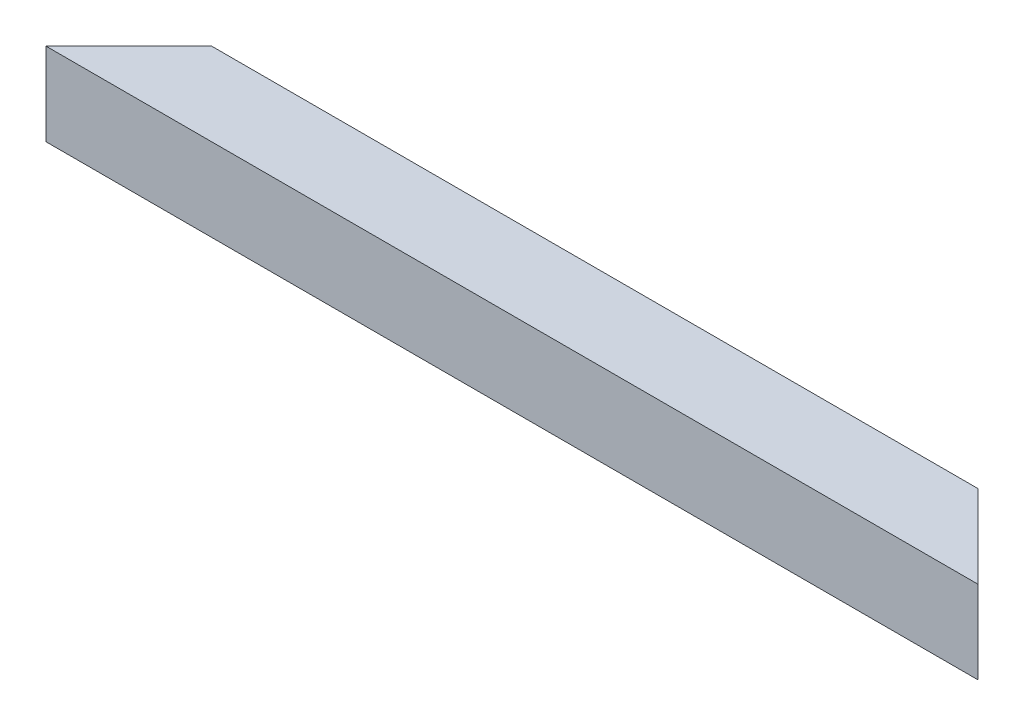
ISO-10303-21;
HEADER;
FILE_DESCRIPTION(('STEP AP214'),'2;1');
FILE_NAME('part.step','',(''),(''),'','','');
FILE_SCHEMA(('AUTOMOTIVE_DESIGN { 1 0 10303 214 1 1 1 1 }'));
ENDSEC;
DATA;
#1=APPLICATION_CONTEXT('core data for automotive mechanical design processes');
#2=APPLICATION_PROTOCOL_DEFINITION('international standard','automotive_design',2000,#1);
#3=PRODUCT_CONTEXT('',#1,'mechanical');
#4=PRODUCT('Part','Part','',(#3));
#5=PRODUCT_RELATED_PRODUCT_CATEGORY('part','',(#4));
#6=PRODUCT_DEFINITION_FORMATION('','',#4);
#7=PRODUCT_DEFINITION_CONTEXT('part definition',#1,'design');
#8=PRODUCT_DEFINITION('design','',#6,#7);
#9=PRODUCT_DEFINITION_SHAPE('','',#8);
#10=(LENGTH_UNIT() NAMED_UNIT(*) SI_UNIT(.MILLI.,.METRE.));
#11=(NAMED_UNIT(*) PLANE_ANGLE_UNIT() SI_UNIT($,.RADIAN.));
#12=(NAMED_UNIT(*) SI_UNIT($,.STERADIAN.) SOLID_ANGLE_UNIT());
#13=UNCERTAINTY_MEASURE_WITH_UNIT(LENGTH_MEASURE(1.E-05),#10,'distance_accuracy_value','');
#14=(GEOMETRIC_REPRESENTATION_CONTEXT(3) GLOBAL_UNCERTAINTY_ASSIGNED_CONTEXT((#13)) GLOBAL_UNIT_ASSIGNED_CONTEXT((#10,
#11,#12)) REPRESENTATION_CONTEXT('',''));
#15=CARTESIAN_POINT('',(0.,0.,0.));
#16=DIRECTION('',(0.,0.,1.));
#17=DIRECTION('',(1.,0.,0.));
#18=AXIS2_PLACEMENT_3D('',#15,#16,#17);
#19=CARTESIAN_POINT('',(-164.2,1.2,-1.2));
#20=DIRECTION('',(0.,-1.,0.));
#21=DIRECTION('',(0.,0.,-1.));
#22=AXIS2_PLACEMENT_3D('',#19,#20,#21);
#23=PLANE('',#22);
#24=DIRECTION('',(1.,0.,0.));
#25=VECTOR('',#24,1.);
#26=CARTESIAN_POINT('',(-164.2,1.2,-24.2));
#27=LINE('',#26,#25);
#28=CARTESIAN_POINT('',(24.1999999999999,1.2,-24.2));
#29=VERTEX_POINT('',#28);
#30=CARTESIAN_POINT('',(261.6,1.2,-24.2));
#31=VERTEX_POINT('',#30);
#32=EDGE_CURVE('E152',#29,#31,#27,.T.);
#33=ORIENTED_EDGE('',*,*,#32,.F.);
#34=DIRECTION('',(-0.707106781186546,0.,0.707106781186549));
#35=VECTOR('',#34,1.);
#36=CARTESIAN_POINT('',(-81.4999999999997,1.2,81.5));
#37=LINE('',#36,#35);
#38=CARTESIAN_POINT('',(1.19999999999998,1.2,-1.2));
#39=VERTEX_POINT('',#38);
#40=EDGE_CURVE('E11',#29,#39,#37,.T.);
#41=ORIENTED_EDGE('',*,*,#40,.T.);
#42=DIRECTION('',(1.,0.,0.));
#43=VECTOR('',#42,1.);
#44=CARTESIAN_POINT('',(-164.2,1.2,-1.2));
#45=LINE('',#44,#43);
#46=CARTESIAN_POINT('',(284.6,1.2,-1.20000000000003));
#47=VERTEX_POINT('',#46);
#48=EDGE_CURVE('E148',#39,#47,#45,.T.);
#49=ORIENTED_EDGE('',*,*,#48,.T.);
#50=DIRECTION('',(-0.707106781186551,0.,-0.707106781186544));
#51=VECTOR('',#50,1.);
#52=CARTESIAN_POINT('',(60.1999999999977,1.2,-225.6));
#53=LINE('',#52,#51);
#54=EDGE_CURVE('E52',#47,#31,#53,.T.);
#55=ORIENTED_EDGE('',*,*,#54,.T.);
#56=EDGE_LOOP('',(#33,#41,#49,#55));
#57=FACE_BOUND('',#56,.T.);
#58=ADVANCED_FACE('F43',(#57),#23,.F.);
#59=CARTESIAN_POINT('',(-164.2,24.2,-24.2));
#60=DIRECTION('',(0.,0.,-1.));
#61=DIRECTION('',(0.,1.,0.));
#62=AXIS2_PLACEMENT_3D('',#59,#60,#61);
#63=PLANE('',#62);
#64=DIRECTION('',(1.,0.,0.));
#65=VECTOR('',#64,1.);
#66=CARTESIAN_POINT('',(-164.2,24.2,-24.2));
#67=LINE('',#66,#65);
#68=CARTESIAN_POINT('',(24.1999999999999,24.2,-24.2));
#69=VERTEX_POINT('',#68);
#70=CARTESIAN_POINT('',(261.6,24.2,-24.2));
#71=VERTEX_POINT('',#70);
#72=EDGE_CURVE('E157',#69,#71,#67,.T.);
#73=ORIENTED_EDGE('',*,*,#72,.F.);
#74=DIRECTION('',(0.,-1.,0.));
#75=VECTOR('',#74,1.);
#76=CARTESIAN_POINT('',(24.1999999999999,24.2,-24.2));
#77=LINE('',#76,#75);
#78=EDGE_CURVE('E171',#69,#29,#77,.T.);
#79=ORIENTED_EDGE('',*,*,#78,.T.);
#80=ORIENTED_EDGE('',*,*,#32,.T.);
#81=DIRECTION('',(0.,1.,0.));
#82=VECTOR('',#81,1.);
#83=CARTESIAN_POINT('',(261.6,24.1999999999999,-24.2));
#84=LINE('',#83,#82);
#85=EDGE_CURVE('E67',#31,#71,#84,.T.);
#86=ORIENTED_EDGE('',*,*,#85,.T.);
#87=EDGE_LOOP('',(#73,#79,#80,#86));
#88=FACE_BOUND('',#87,.T.);
#89=ADVANCED_FACE('F212',(#88),#63,.F.);
#90=CARTESIAN_POINT('',(-164.2,24.2,-1.2));
#91=DIRECTION('',(0.,1.,0.));
#92=DIRECTION('',(0.,0.,1.));
#93=AXIS2_PLACEMENT_3D('',#90,#91,#92);
#94=PLANE('',#93);
#95=DIRECTION('',(1.,0.,0.));
#96=VECTOR('',#95,1.);
#97=CARTESIAN_POINT('',(-164.2,24.2,-1.2));
#98=LINE('',#97,#96);
#99=CARTESIAN_POINT('',(1.19999999999998,24.2,-1.20000000000001));
#100=VERTEX_POINT('',#99);
#101=CARTESIAN_POINT('',(284.6,24.2,-1.20000000000003));
#102=VERTEX_POINT('',#101);
#103=EDGE_CURVE('E128',#100,#102,#98,.T.);
#104=ORIENTED_EDGE('',*,*,#103,.F.);
#105=DIRECTION('',(0.707106781186546,0.,-0.707106781186549));
#106=VECTOR('',#105,1.);
#107=CARTESIAN_POINT('',(-81.4999999999997,24.2,81.5));
#108=LINE('',#107,#106);
#109=EDGE_CURVE('E167',#100,#69,#108,.T.);
#110=ORIENTED_EDGE('',*,*,#109,.T.);
#111=ORIENTED_EDGE('',*,*,#72,.T.);
#112=DIRECTION('',(0.707106781186551,0.,0.707106781186544));
#113=VECTOR('',#112,1.);
#114=CARTESIAN_POINT('',(60.1999999999977,24.2,-225.6));
#115=LINE('',#114,#113);
#116=EDGE_CURVE('E179',#71,#102,#115,.T.);
#117=ORIENTED_EDGE('',*,*,#116,.T.);
#118=EDGE_LOOP('',(#104,#110,#111,#117));
#119=FACE_BOUND('',#118,.T.);
#120=ADVANCED_FACE('F214',(#119),#94,.F.);
#121=CARTESIAN_POINT('',(-164.2,24.2,-1.2));
#122=DIRECTION('',(0.,0.,1.));
#123=DIRECTION('',(0.,-1.,0.));
#124=AXIS2_PLACEMENT_3D('',#121,#122,#123);
#125=PLANE('',#124);
#126=ORIENTED_EDGE('',*,*,#48,.F.);
#127=DIRECTION('',(0.,1.,0.));
#128=VECTOR('',#127,1.);
#129=CARTESIAN_POINT('',(1.19999999999998,24.2,-1.2));
#130=LINE('',#129,#128);
#131=EDGE_CURVE('E153',#39,#100,#130,.T.);
#132=ORIENTED_EDGE('',*,*,#131,.T.);
#133=ORIENTED_EDGE('',*,*,#103,.T.);
#134=DIRECTION('',(0.,-1.,0.));
#135=VECTOR('',#134,1.);
#136=CARTESIAN_POINT('',(284.6,24.1999999999999,-1.2));
#137=LINE('',#136,#135);
#138=EDGE_CURVE('E175',#102,#47,#137,.T.);
#139=ORIENTED_EDGE('',*,*,#138,.T.);
#140=EDGE_LOOP('',(#126,#132,#133,#139));
#141=FACE_BOUND('',#140,.T.);
#142=ADVANCED_FACE('F206',(#141),#125,.F.);
#143=CARTESIAN_POINT('',(285.8,0.,0.));
#144=DIRECTION('',(-0.707106781186544,0.,0.707106781186551));
#145=DIRECTION('',(0.707106781186551,0.,0.707106781186544));
#146=AXIS2_PLACEMENT_3D('',#143,#144,#145);
#147=PLANE('',#146);
#148=DIRECTION('',(0.707106781186551,0.,0.707106781186544));
#149=VECTOR('',#148,1.);
#150=CARTESIAN_POINT('',(285.8,25.4,0.));
#151=LINE('',#150,#149);
#152=CARTESIAN_POINT('',(260.4,25.4,-25.4));
#153=VERTEX_POINT('',#152);
#154=CARTESIAN_POINT('',(285.8,25.4,0.));
#155=VERTEX_POINT('',#154);
#156=EDGE_CURVE('E187',#153,#155,#151,.T.);
#157=ORIENTED_EDGE('',*,*,#156,.T.);
#158=DIRECTION('',(0.,-1.,0.));
#159=VECTOR('',#158,1.);
#160=CARTESIAN_POINT('',(285.8,25.4,0.));
#161=LINE('',#160,#159);
#162=CARTESIAN_POINT('',(285.8,0.,0.));
#163=VERTEX_POINT('',#162);
#164=EDGE_CURVE('E134',#155,#163,#161,.T.);
#165=ORIENTED_EDGE('',*,*,#164,.T.);
#166=DIRECTION('',(0.707106781186551,0.,0.707106781186544));
#167=VECTOR('',#166,1.);
#168=CARTESIAN_POINT('',(285.8,0.,0.));
#169=LINE('',#168,#167);
#170=CARTESIAN_POINT('',(260.4,0.,-25.4));
#171=VERTEX_POINT('',#170);
#172=EDGE_CURVE('E123',#171,#163,#169,.T.);
#173=ORIENTED_EDGE('',*,*,#172,.F.);
#174=DIRECTION('',(0.,1.,0.));
#175=VECTOR('',#174,1.);
#176=CARTESIAN_POINT('',(260.4,0.,-25.4));
#177=LINE('',#176,#175);
#178=EDGE_CURVE('E188',#171,#153,#177,.T.);
#179=ORIENTED_EDGE('',*,*,#178,.T.);
#180=EDGE_LOOP('',(#157,#165,#173,#179));
#181=FACE_BOUND('',#180,.T.);
#182=ORIENTED_EDGE('',*,*,#116,.F.);
#183=ORIENTED_EDGE('',*,*,#85,.F.);
#184=ORIENTED_EDGE('',*,*,#54,.F.);
#185=ORIENTED_EDGE('',*,*,#138,.F.);
#186=EDGE_LOOP('',(#182,#183,#184,#185));
#187=FACE_BOUND('',#186,.T.);
#188=ADVANCED_FACE('F204',(#181,#187),#147,.F.);
#189=CARTESIAN_POINT('',(0.,0.,0.));
#190=DIRECTION('',(0.707106781186549,0.,0.707106781186546));
#191=DIRECTION('',(0.707106781186546,0.,-0.707106781186549));
#192=AXIS2_PLACEMENT_3D('',#189,#190,#191);
#193=PLANE('',#192);
#194=DIRECTION('',(0.707106781186546,0.,-0.707106781186549));
#195=VECTOR('',#194,1.);
#196=CARTESIAN_POINT('',(0.,25.4,0.));
#197=LINE('',#196,#195);
#198=CARTESIAN_POINT('',(0.,25.4,0.));
#199=VERTEX_POINT('',#198);
#200=CARTESIAN_POINT('',(25.3999999999999,25.4,-25.4));
#201=VERTEX_POINT('',#200);
#202=EDGE_CURVE('E117',#199,#201,#197,.T.);
#203=ORIENTED_EDGE('',*,*,#202,.T.);
#204=DIRECTION('',(0.,1.,0.));
#205=VECTOR('',#204,1.);
#206=CARTESIAN_POINT('',(25.3999999999999,0.,-25.4));
#207=LINE('',#206,#205);
#208=CARTESIAN_POINT('',(25.3999999999999,0.,-25.3999999999999));
#209=VERTEX_POINT('',#208);
#210=EDGE_CURVE('E59',#209,#201,#207,.T.);
#211=ORIENTED_EDGE('',*,*,#210,.F.);
#212=DIRECTION('',(0.707106781186546,0.,-0.707106781186549));
#213=VECTOR('',#212,1.);
#214=CARTESIAN_POINT('',(0.,0.,0.));
#215=LINE('',#214,#213);
#216=CARTESIAN_POINT('',(0.,0.,0.));
#217=VERTEX_POINT('',#216);
#218=EDGE_CURVE('E106',#217,#209,#215,.T.);
#219=ORIENTED_EDGE('',*,*,#218,.F.);
#220=DIRECTION('',(0.,-1.,0.));
#221=VECTOR('',#220,1.);
#222=CARTESIAN_POINT('',(0.,25.4,0.));
#223=LINE('',#222,#221);
#224=EDGE_CURVE('E111',#199,#217,#223,.T.);
#225=ORIENTED_EDGE('',*,*,#224,.F.);
#226=EDGE_LOOP('',(#203,#211,#219,#225));
#227=FACE_BOUND('',#226,.T.);
#228=ORIENTED_EDGE('',*,*,#40,.F.);
#229=ORIENTED_EDGE('',*,*,#78,.F.);
#230=ORIENTED_EDGE('',*,*,#109,.F.);
#231=ORIENTED_EDGE('',*,*,#131,.F.);
#232=EDGE_LOOP('',(#228,#229,#230,#231));
#233=FACE_BOUND('',#232,.T.);
#234=ADVANCED_FACE('F108',(#227,#233),#193,.F.);
#235=CARTESIAN_POINT('',(0.,25.4,0.));
#236=DIRECTION('',(0.,0.,-1.));
#237=DIRECTION('',(-1.,0.,0.));
#238=AXIS2_PLACEMENT_3D('',#235,#236,#237);
#239=PLANE('',#238);
#240=DIRECTION('',(1.,0.,0.));
#241=VECTOR('',#240,1.);
#242=CARTESIAN_POINT('',(0.,0.,0.));
#243=LINE('',#242,#241);
#244=EDGE_CURVE('E121',#217,#163,#243,.T.);
#245=ORIENTED_EDGE('',*,*,#244,.T.);
#246=ORIENTED_EDGE('',*,*,#164,.F.);
#247=DIRECTION('',(1.,0.,0.));
#248=VECTOR('',#247,1.);
#249=CARTESIAN_POINT('',(0.,25.4,0.));
#250=LINE('',#249,#248);
#251=EDGE_CURVE('E132',#199,#155,#250,.T.);
#252=ORIENTED_EDGE('',*,*,#251,.F.);
#253=ORIENTED_EDGE('',*,*,#224,.T.);
#254=EDGE_LOOP('',(#245,#246,#252,#253));
#255=FACE_BOUND('',#254,.T.);
#256=ADVANCED_FACE('F45',(#255),#239,.F.);
#257=CARTESIAN_POINT('',(285.8,25.4,-25.4));
#258=DIRECTION('',(0.,0.,1.));
#259=DIRECTION('',(1.,0.,0.));
#260=AXIS2_PLACEMENT_3D('',#257,#258,#259);
#261=PLANE('',#260);
#262=DIRECTION('',(-1.,0.,0.));
#263=VECTOR('',#262,1.);
#264=CARTESIAN_POINT('',(285.8,0.,-25.4));
#265=LINE('',#264,#263);
#266=EDGE_CURVE('E127',#171,#209,#265,.T.);
#267=ORIENTED_EDGE('',*,*,#266,.T.);
#268=ORIENTED_EDGE('',*,*,#210,.T.);
#269=DIRECTION('',(-1.,0.,0.));
#270=VECTOR('',#269,1.);
#271=CARTESIAN_POINT('',(285.8,25.4,-25.4));
#272=LINE('',#271,#270);
#273=EDGE_CURVE('E138',#153,#201,#272,.T.);
#274=ORIENTED_EDGE('',*,*,#273,.F.);
#275=ORIENTED_EDGE('',*,*,#178,.F.);
#276=EDGE_LOOP('',(#267,#268,#274,#275));
#277=FACE_BOUND('',#276,.T.);
#278=ADVANCED_FACE('F199',(#277),#261,.F.);
#279=CARTESIAN_POINT('',(0.,25.4,0.));
#280=DIRECTION('',(0.,1.,0.));
#281=DIRECTION('',(0.,0.,1.));
#282=AXIS2_PLACEMENT_3D('',#279,#280,#281);
#283=PLANE('',#282);
#284=ORIENTED_EDGE('',*,*,#202,.F.);
#285=ORIENTED_EDGE('',*,*,#251,.T.);
#286=ORIENTED_EDGE('',*,*,#156,.F.);
#287=ORIENTED_EDGE('',*,*,#273,.T.);
#288=EDGE_LOOP('',(#284,#285,#286,#287));
#289=FACE_BOUND('',#288,.T.);
#290=ADVANCED_FACE('F202',(#289),#283,.T.);
#291=CARTESIAN_POINT('',(0.,0.,0.));
#292=DIRECTION('',(0.,1.,0.));
#293=DIRECTION('',(0.,0.,1.));
#294=AXIS2_PLACEMENT_3D('',#291,#292,#293);
#295=PLANE('',#294);
#296=ORIENTED_EDGE('',*,*,#244,.F.);
#297=ORIENTED_EDGE('',*,*,#218,.T.);
#298=ORIENTED_EDGE('',*,*,#266,.F.);
#299=ORIENTED_EDGE('',*,*,#172,.T.);
#300=EDGE_LOOP('',(#296,#297,#298,#299));
#301=FACE_BOUND('',#300,.T.);
#302=ADVANCED_FACE('F122',(#301),#295,.F.);
#303=CLOSED_SHELL('',(#58,#89,#120,#142,#188,#234,#256,#278,#290,#302));
#304=MANIFOLD_SOLID_BREP('B2',#303);
#305=ADVANCED_BREP_SHAPE_REPRESENTATION('',(#18,#304),#14);
#306=SHAPE_DEFINITION_REPRESENTATION(#9,#305);
ENDSEC;
END-ISO-10303-21;
